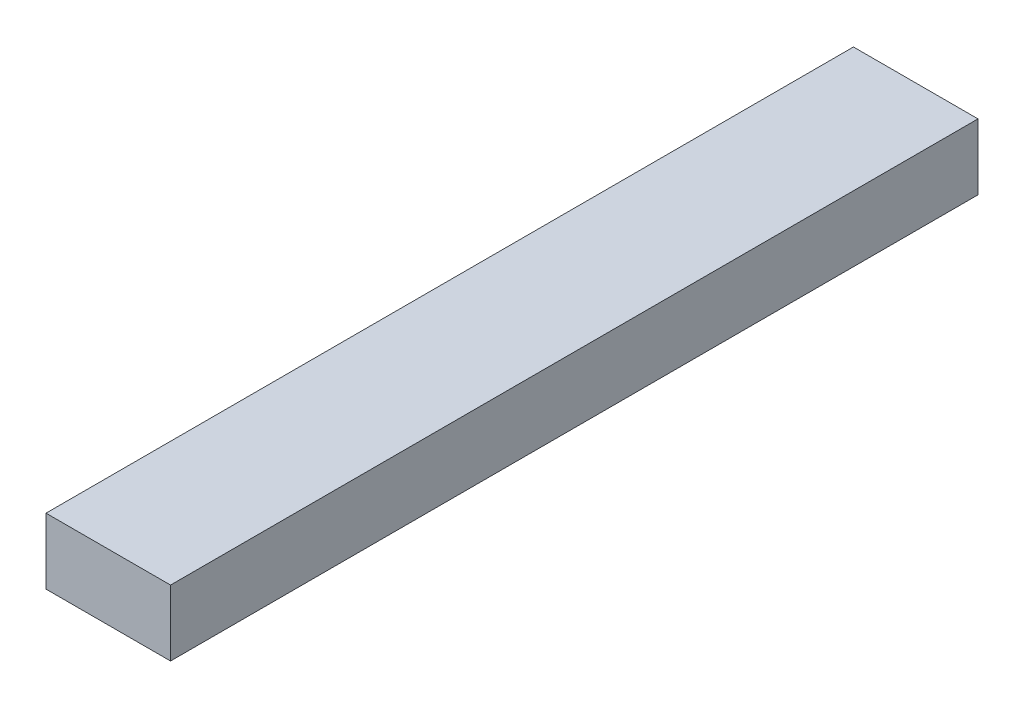
ISO-10303-21;
HEADER;
FILE_DESCRIPTION(('STEP AP214'),'2;1');
FILE_NAME('part.step','',(''),(''),'','','');
FILE_SCHEMA(('AUTOMOTIVE_DESIGN { 1 0 10303 214 1 1 1 1 }'));
ENDSEC;
DATA;
#1=APPLICATION_CONTEXT('core data for automotive mechanical design processes');
#2=APPLICATION_PROTOCOL_DEFINITION('international standard','automotive_design',2000,#1);
#3=PRODUCT_CONTEXT('',#1,'mechanical');
#4=PRODUCT('Part','Part','',(#3));
#5=PRODUCT_RELATED_PRODUCT_CATEGORY('part','',(#4));
#6=PRODUCT_DEFINITION_FORMATION('','',#4);
#7=PRODUCT_DEFINITION_CONTEXT('part definition',#1,'design');
#8=PRODUCT_DEFINITION('design','',#6,#7);
#9=PRODUCT_DEFINITION_SHAPE('','',#8);
#10=(LENGTH_UNIT() NAMED_UNIT(*) SI_UNIT(.MILLI.,.METRE.));
#11=(NAMED_UNIT(*) PLANE_ANGLE_UNIT() SI_UNIT($,.RADIAN.));
#12=(NAMED_UNIT(*) SI_UNIT($,.STERADIAN.) SOLID_ANGLE_UNIT());
#13=UNCERTAINTY_MEASURE_WITH_UNIT(LENGTH_MEASURE(1.E-05),#10,'distance_accuracy_value','');
#14=(GEOMETRIC_REPRESENTATION_CONTEXT(3) GLOBAL_UNCERTAINTY_ASSIGNED_CONTEXT((#13)) GLOBAL_UNIT_ASSIGNED_CONTEXT((#10,
#11,#12)) REPRESENTATION_CONTEXT('',''));
#15=CARTESIAN_POINT('',(0.,0.,0.));
#16=DIRECTION('',(0.,0.,1.));
#17=DIRECTION('',(1.,0.,0.));
#18=AXIS2_PLACEMENT_3D('',#15,#16,#17);
#19=CARTESIAN_POINT('',(0.,10.414,0.));
#20=DIRECTION('',(1.,0.,0.));
#21=DIRECTION('',(0.,0.,-1.));
#22=AXIS2_PLACEMENT_3D('',#19,#20,#21);
#23=PLANE('',#22);
#24=DIRECTION('',(0.,0.,1.));
#25=VECTOR('',#24,1.);
#26=CARTESIAN_POINT('',(0.,0.,0.));
#27=LINE('',#26,#25);
#28=CARTESIAN_POINT('',(0.,0.,-127.79375));
#29=VERTEX_POINT('',#28);
#30=CARTESIAN_POINT('',(0.,0.,0.));
#31=VERTEX_POINT('',#30);
#32=EDGE_CURVE('E99',#29,#31,#27,.T.);
#33=ORIENTED_EDGE('',*,*,#32,.T.);
#34=DIRECTION('',(0.,-1.,0.));
#35=VECTOR('',#34,1.);
#36=CARTESIAN_POINT('',(0.,10.414,0.));
#37=LINE('',#36,#35);
#38=CARTESIAN_POINT('',(0.,10.414,0.));
#39=VERTEX_POINT('',#38);
#40=EDGE_CURVE('E11',#39,#31,#37,.T.);
#41=ORIENTED_EDGE('',*,*,#40,.F.);
#42=DIRECTION('',(0.,0.,1.));
#43=VECTOR('',#42,1.);
#44=CARTESIAN_POINT('',(0.,10.414,0.));
#45=LINE('',#44,#43);
#46=CARTESIAN_POINT('',(0.,10.414,-127.79375));
#47=VERTEX_POINT('',#46);
#48=EDGE_CURVE('E87',#47,#39,#45,.T.);
#49=ORIENTED_EDGE('',*,*,#48,.F.);
#50=DIRECTION('',(0.,-1.,0.));
#51=VECTOR('',#50,1.);
#52=CARTESIAN_POINT('',(0.,10.414,-127.79375));
#53=LINE('',#52,#51);
#54=EDGE_CURVE('E95',#47,#29,#53,.T.);
#55=ORIENTED_EDGE('',*,*,#54,.T.);
#56=EDGE_LOOP('',(#33,#41,#49,#55));
#57=FACE_BOUND('',#56,.T.);
#58=ADVANCED_FACE('F36',(#57),#23,.F.);
#59=CARTESIAN_POINT('',(0.,10.414,0.));
#60=DIRECTION('',(0.,0.,-1.));
#61=DIRECTION('',(-1.,0.,0.));
#62=AXIS2_PLACEMENT_3D('',#59,#60,#61);
#63=PLANE('',#62);
#64=DIRECTION('',(1.,0.,0.));
#65=VECTOR('',#64,1.);
#66=CARTESIAN_POINT('',(0.,0.,0.));
#67=LINE('',#66,#65);
#68=CARTESIAN_POINT('',(19.7104,0.,0.));
#69=VERTEX_POINT('',#68);
#70=EDGE_CURVE('E91',#31,#69,#67,.T.);
#71=ORIENTED_EDGE('',*,*,#70,.T.);
#72=DIRECTION('',(0.,-1.,0.));
#73=VECTOR('',#72,1.);
#74=CARTESIAN_POINT('',(19.7104,10.414,0.));
#75=LINE('',#74,#73);
#76=CARTESIAN_POINT('',(19.7104,10.414,0.));
#77=VERTEX_POINT('',#76);
#78=EDGE_CURVE('E44',#77,#69,#75,.T.);
#79=ORIENTED_EDGE('',*,*,#78,.F.);
#80=DIRECTION('',(1.,0.,0.));
#81=VECTOR('',#80,1.);
#82=CARTESIAN_POINT('',(0.,10.414,0.));
#83=LINE('',#82,#81);
#84=EDGE_CURVE('E82',#39,#77,#83,.T.);
#85=ORIENTED_EDGE('',*,*,#84,.F.);
#86=ORIENTED_EDGE('',*,*,#40,.T.);
#87=EDGE_LOOP('',(#71,#79,#85,#86));
#88=FACE_BOUND('',#87,.T.);
#89=ADVANCED_FACE('F90',(#88),#63,.F.);
#90=CARTESIAN_POINT('',(19.7104,10.414,0.));
#91=DIRECTION('',(-1.,0.,0.));
#92=DIRECTION('',(0.,0.,1.));
#93=AXIS2_PLACEMENT_3D('',#90,#91,#92);
#94=PLANE('',#93);
#95=DIRECTION('',(0.,0.,-1.));
#96=VECTOR('',#95,1.);
#97=CARTESIAN_POINT('',(19.7104,0.,0.));
#98=LINE('',#97,#96);
#99=CARTESIAN_POINT('',(19.7104,0.,-127.79375));
#100=VERTEX_POINT('',#99);
#101=EDGE_CURVE('E69',#69,#100,#98,.T.);
#102=ORIENTED_EDGE('',*,*,#101,.T.);
#103=DIRECTION('',(0.,-1.,0.));
#104=VECTOR('',#103,1.);
#105=CARTESIAN_POINT('',(19.7104,10.414,-127.79375));
#106=LINE('',#105,#104);
#107=CARTESIAN_POINT('',(19.7104,10.414,-127.79375));
#108=VERTEX_POINT('',#107);
#109=EDGE_CURVE('E92',#108,#100,#106,.T.);
#110=ORIENTED_EDGE('',*,*,#109,.F.);
#111=DIRECTION('',(0.,0.,-1.));
#112=VECTOR('',#111,1.);
#113=CARTESIAN_POINT('',(19.7104,10.414,0.));
#114=LINE('',#113,#112);
#115=EDGE_CURVE('E85',#77,#108,#114,.T.);
#116=ORIENTED_EDGE('',*,*,#115,.F.);
#117=ORIENTED_EDGE('',*,*,#78,.T.);
#118=EDGE_LOOP('',(#102,#110,#116,#117));
#119=FACE_BOUND('',#118,.T.);
#120=ADVANCED_FACE('F93',(#119),#94,.F.);
#121=CARTESIAN_POINT('',(0.,10.414,-127.79375));
#122=DIRECTION('',(0.,0.,1.));
#123=DIRECTION('',(1.,0.,0.));
#124=AXIS2_PLACEMENT_3D('',#121,#122,#123);
#125=PLANE('',#124);
#126=DIRECTION('',(-1.,0.,0.));
#127=VECTOR('',#126,1.);
#128=CARTESIAN_POINT('',(0.,0.,-127.79375));
#129=LINE('',#128,#127);
#130=EDGE_CURVE('E75',#100,#29,#129,.T.);
#131=ORIENTED_EDGE('',*,*,#130,.T.);
#132=ORIENTED_EDGE('',*,*,#54,.F.);
#133=DIRECTION('',(-1.,0.,0.));
#134=VECTOR('',#133,1.);
#135=CARTESIAN_POINT('',(0.,10.414,-127.79375));
#136=LINE('',#135,#134);
#137=EDGE_CURVE('E52',#108,#47,#136,.T.);
#138=ORIENTED_EDGE('',*,*,#137,.F.);
#139=ORIENTED_EDGE('',*,*,#109,.T.);
#140=EDGE_LOOP('',(#131,#132,#138,#139));
#141=FACE_BOUND('',#140,.T.);
#142=ADVANCED_FACE('F106',(#141),#125,.F.);
#143=CARTESIAN_POINT('',(0.,10.414,0.));
#144=DIRECTION('',(0.,-1.,0.));
#145=DIRECTION('',(0.,0.,-1.));
#146=AXIS2_PLACEMENT_3D('',#143,#144,#145);
#147=PLANE('',#146);
#148=ORIENTED_EDGE('',*,*,#48,.T.);
#149=ORIENTED_EDGE('',*,*,#84,.T.);
#150=ORIENTED_EDGE('',*,*,#115,.T.);
#151=ORIENTED_EDGE('',*,*,#137,.T.);
#152=EDGE_LOOP('',(#148,#149,#150,#151));
#153=FACE_BOUND('',#152,.T.);
#154=ADVANCED_FACE('F83',(#153),#147,.F.);
#155=CARTESIAN_POINT('',(0.,0.,0.));
#156=DIRECTION('',(0.,-1.,0.));
#157=DIRECTION('',(0.,0.,-1.));
#158=AXIS2_PLACEMENT_3D('',#155,#156,#157);
#159=PLANE('',#158);
#160=ORIENTED_EDGE('',*,*,#32,.F.);
#161=ORIENTED_EDGE('',*,*,#130,.F.);
#162=ORIENTED_EDGE('',*,*,#101,.F.);
#163=ORIENTED_EDGE('',*,*,#70,.F.);
#164=EDGE_LOOP('',(#160,#161,#162,#163));
#165=FACE_BOUND('',#164,.T.);
#166=ADVANCED_FACE('F109',(#165),#159,.T.);
#167=CLOSED_SHELL('',(#58,#89,#120,#142,#154,#166));
#168=MANIFOLD_SOLID_BREP('B2',#167);
#169=ADVANCED_BREP_SHAPE_REPRESENTATION('',(#18,#168),#14);
#170=SHAPE_DEFINITION_REPRESENTATION(#9,#169);
ENDSEC;
END-ISO-10303-21;
